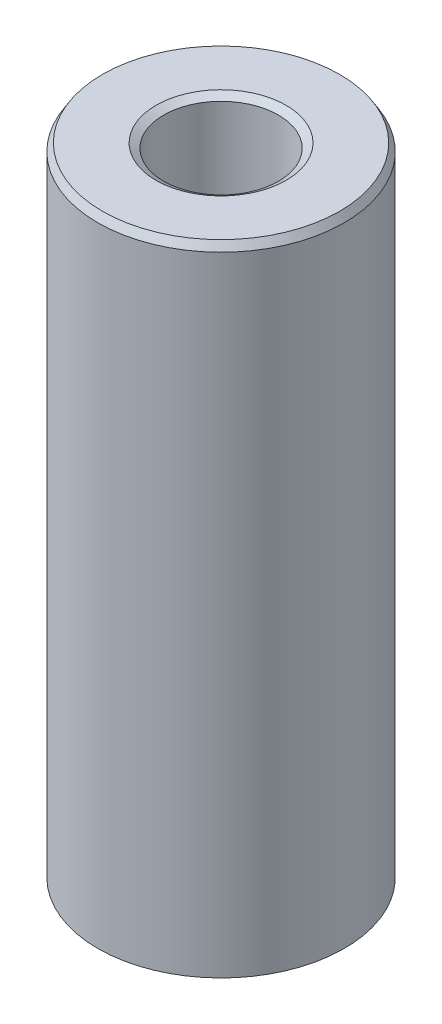
ISO-10303-21;
HEADER;
FILE_DESCRIPTION(('STEP AP214'),'2;1');
FILE_NAME('part.step','',(''),(''),'','','');
FILE_SCHEMA(('AUTOMOTIVE_DESIGN { 1 0 10303 214 1 1 1 1 }'));
ENDSEC;
DATA;
#1=APPLICATION_CONTEXT('core data for automotive mechanical design processes');
#2=APPLICATION_PROTOCOL_DEFINITION('international standard','automotive_design',2000,#1);
#3=PRODUCT_CONTEXT('',#1,'mechanical');
#4=PRODUCT('Part','Part','',(#3));
#5=PRODUCT_RELATED_PRODUCT_CATEGORY('part','',(#4));
#6=PRODUCT_DEFINITION_FORMATION('','',#4);
#7=PRODUCT_DEFINITION_CONTEXT('part definition',#1,'design');
#8=PRODUCT_DEFINITION('design','',#6,#7);
#9=PRODUCT_DEFINITION_SHAPE('','',#8);
#10=(LENGTH_UNIT() NAMED_UNIT(*) SI_UNIT(.MILLI.,.METRE.));
#11=(NAMED_UNIT(*) PLANE_ANGLE_UNIT() SI_UNIT($,.RADIAN.));
#12=(NAMED_UNIT(*) SI_UNIT($,.STERADIAN.) SOLID_ANGLE_UNIT());
#13=UNCERTAINTY_MEASURE_WITH_UNIT(LENGTH_MEASURE(1.E-05),#10,'distance_accuracy_value','');
#14=(GEOMETRIC_REPRESENTATION_CONTEXT(3) GLOBAL_UNCERTAINTY_ASSIGNED_CONTEXT((#13)) GLOBAL_UNIT_ASSIGNED_CONTEXT((#10,
#11,#12)) REPRESENTATION_CONTEXT('',''));
#15=CARTESIAN_POINT('',(0.,0.,0.));
#16=DIRECTION('',(0.,0.,1.));
#17=DIRECTION('',(1.,0.,0.));
#18=AXIS2_PLACEMENT_3D('',#15,#16,#17);
#19=CARTESIAN_POINT('',(0.,39.0098005050127,0.));
#20=DIRECTION('',(0.,-1.,0.));
#21=DIRECTION('',(0.,0.,-1.));
#22=AXIS2_PLACEMENT_3D('',#19,#20,#21);
#23=CYLINDRICAL_SURFACE('',#22,7.5);
#24=CARTESIAN_POINT('',(0.,0.280817783789404,0.));
#25=DIRECTION('',(0.,1.,0.));
#26=DIRECTION('',(0.,0.,1.));
#27=AXIS2_PLACEMENT_3D('',#24,#25,#26);
#28=CIRCLE('',#27,7.5);
#29=CARTESIAN_POINT('',(0.,0.280817783789404,7.5));
#30=VERTEX_POINT('',#29);
#31=EDGE_CURVE('E10',#30,#30,#28,.T.);
#32=ORIENTED_EDGE('',*,*,#31,.T.);
#33=EDGE_LOOP('',(#32));
#34=FACE_BOUND('',#33,.T.);
#35=CARTESIAN_POINT('',(0.,38.5429100247802,0.));
#36=DIRECTION('',(0.,1.,0.));
#37=DIRECTION('',(0.,0.,1.));
#38=AXIS2_PLACEMENT_3D('',#35,#36,#37);
#39=CIRCLE('',#38,7.5);
#40=CARTESIAN_POINT('',(0.,38.5429100247802,7.5));
#41=VERTEX_POINT('',#40);
#42=EDGE_CURVE('E50',#41,#41,#39,.F.);
#43=ORIENTED_EDGE('',*,*,#42,.T.);
#44=EDGE_LOOP('',(#43));
#45=FACE_BOUND('',#44,.T.);
#46=ADVANCED_FACE('F39',(#34,#45),#23,.T.);
#47=CARTESIAN_POINT('',(0.,39.0098005050127,0.));
#48=DIRECTION('',(0.,1.,0.));
#49=DIRECTION('',(0.,0.,1.));
#50=AXIS2_PLACEMENT_3D('',#47,#48,#49);
#51=PLANE('',#50);
#52=CARTESIAN_POINT('',(0.,39.0098005050127,0.));
#53=DIRECTION('',(0.,1.,0.));
#54=DIRECTION('',(0.,0.,1.));
#55=AXIS2_PLACEMENT_3D('',#52,#53,#54);
#56=CIRCLE('',#55,3.96074561842094);
#57=CARTESIAN_POINT('',(0.,39.0098005050127,3.96074561842094));
#58=VERTEX_POINT('',#57);
#59=EDGE_CURVE('E58',#58,#58,#56,.F.);
#60=ORIENTED_EDGE('',*,*,#59,.T.);
#61=EDGE_LOOP('',(#60));
#62=FACE_BOUND('',#61,.T.);
#63=CARTESIAN_POINT('',(0.,39.0098005050127,0.));
#64=DIRECTION('',(0.,1.,0.));
#65=DIRECTION('',(0.,0.,1.));
#66=AXIS2_PLACEMENT_3D('',#63,#64,#65);
#67=CIRCLE('',#66,7.21918221621058);
#68=CARTESIAN_POINT('',(0.,39.0098005050127,7.21918221621058));
#69=VERTEX_POINT('',#68);
#70=EDGE_CURVE('E61',#69,#69,#67,.T.);
#71=ORIENTED_EDGE('',*,*,#70,.T.);
#72=EDGE_LOOP('',(#71));
#73=FACE_BOUND('',#72,.T.);
#74=ADVANCED_FACE('F88',(#62,#73),#51,.T.);
#75=CARTESIAN_POINT('',(0.,0.,0.));
#76=DIRECTION('',(0.,1.,0.));
#77=DIRECTION('',(0.,0.,1.));
#78=AXIS2_PLACEMENT_3D('',#75,#76,#77);
#79=PLANE('',#78);
#80=CARTESIAN_POINT('',(0.,0.,0.));
#81=DIRECTION('',(0.,1.,0.));
#82=DIRECTION('',(0.,0.,1.));
#83=AXIS2_PLACEMENT_3D('',#80,#81,#82);
#84=CIRCLE('',#83,3.77467292197792);
#85=CARTESIAN_POINT('',(0.,0.,3.77467292197792));
#86=VERTEX_POINT('',#85);
#87=EDGE_CURVE('E51',#86,#86,#84,.T.);
#88=ORIENTED_EDGE('',*,*,#87,.T.);
#89=EDGE_LOOP('',(#88));
#90=FACE_BOUND('',#89,.T.);
#91=CARTESIAN_POINT('',(0.,0.,0.));
#92=DIRECTION('',(0.,1.,0.));
#93=DIRECTION('',(0.,0.,1.));
#94=AXIS2_PLACEMENT_3D('',#91,#92,#93);
#95=CIRCLE('',#94,7.03310951976756);
#96=CARTESIAN_POINT('',(0.,0.,7.03310951976756));
#97=VERTEX_POINT('',#96);
#98=EDGE_CURVE('E54',#97,#97,#95,.F.);
#99=ORIENTED_EDGE('',*,*,#98,.T.);
#100=EDGE_LOOP('',(#99));
#101=FACE_BOUND('',#100,.T.);
#102=ADVANCED_FACE('F83',(#90,#101),#79,.F.);
#103=CARTESIAN_POINT('',(0.,39.0098005050127,0.));
#104=DIRECTION('',(0.,-1.,0.));
#105=DIRECTION('',(0.,0.,-1.));
#106=AXIS2_PLACEMENT_3D('',#103,#104,#105);
#107=CYLINDRICAL_SURFACE('',#106,3.49385513818851);
#108=CARTESIAN_POINT('',(0.,38.7289827212233,0.));
#109=DIRECTION('',(0.,1.,0.));
#110=DIRECTION('',(0.,0.,1.));
#111=AXIS2_PLACEMENT_3D('',#108,#109,#110);
#112=CIRCLE('',#111,3.49385513818851);
#113=CARTESIAN_POINT('',(0.,38.7289827212233,3.4938551381885));
#114=VERTEX_POINT('',#113);
#115=EDGE_CURVE('E67',#114,#114,#112,.T.);
#116=ORIENTED_EDGE('',*,*,#115,.T.);
#117=EDGE_LOOP('',(#116));
#118=FACE_BOUND('',#117,.T.);
#119=CARTESIAN_POINT('',(0.,0.466890480232435,0.));
#120=DIRECTION('',(0.,1.,0.));
#121=DIRECTION('',(0.,0.,1.));
#122=AXIS2_PLACEMENT_3D('',#119,#120,#121);
#123=CIRCLE('',#122,3.49385513818851);
#124=CARTESIAN_POINT('',(0.,0.466890480232435,3.49385513818851));
#125=VERTEX_POINT('',#124);
#126=EDGE_CURVE('E69',#125,#125,#123,.F.);
#127=ORIENTED_EDGE('',*,*,#126,.T.);
#128=EDGE_LOOP('',(#127));
#129=FACE_BOUND('',#128,.T.);
#130=ADVANCED_FACE('F71',(#118,#129),#107,.F.);
#131=CARTESIAN_POINT('',(0.,38.7289827212233,0.));
#132=DIRECTION('',(0.,1.,0.));
#133=DIRECTION('',(0.,0.,1.));
#134=AXIS2_PLACEMENT_3D('',#131,#132,#133);
#135=CONICAL_SURFACE('',#134,3.49385513818851,1.02930110152719);
#136=CARTESIAN_POINT('',(0.,39.0098005050127,3.96074561842094));
#137=CARTESIAN_POINT('',(0.,39.0068753197649,3.95588217591851));
#138=CARTESIAN_POINT('',(0.,39.0039501345171,3.95101873341609));
#139=CARTESIAN_POINT('',(0.,38.9980997640215,3.94129184841125));
#140=CARTESIAN_POINT('',(0.,38.9951745787737,3.93642840590883));
#141=CARTESIAN_POINT('',(0.,38.9893242082781,3.92670152090399));
#142=CARTESIAN_POINT('',(0.,38.9863990230302,3.92183807840157));
#143=CARTESIAN_POINT('',(0.,38.9805486525346,3.91211119339672));
#144=CARTESIAN_POINT('',(0.,38.9776234672868,3.9072477508943));
#145=CARTESIAN_POINT('',(0.,38.9717730967912,3.89752086588946));
#146=CARTESIAN_POINT('',(0.,38.9688479115434,3.89265742338704));
#147=CARTESIAN_POINT('',(0.,38.9629975410478,3.8829305383822));
#148=CARTESIAN_POINT('',(0.,38.9600723558,3.87806709587978));
#149=CARTESIAN_POINT('',(0.,38.9542219853044,3.86834021087493));
#150=CARTESIAN_POINT('',(0.,38.9512968000566,3.86347676837251));
#151=CARTESIAN_POINT('',(0.,38.945446429561,3.85374988336767));
#152=CARTESIAN_POINT('',(0.,38.9425212443131,3.84888644086525));
#153=CARTESIAN_POINT('',(0.,38.9366708738175,3.83915955586041));
#154=CARTESIAN_POINT('',(0.,38.9337456885697,3.83429611335799));
#155=CARTESIAN_POINT('',(0.,38.9278953180741,3.82456922835314));
#156=CARTESIAN_POINT('',(0.,38.9249701328263,3.81970578585072));
#157=CARTESIAN_POINT('',(0.,38.9191197623307,3.80997890084588));
#158=CARTESIAN_POINT('',(0.,38.9161945770829,3.80511545834346));
#159=CARTESIAN_POINT('',(0.,38.9103442065873,3.79538857333862));
#160=CARTESIAN_POINT('',(0.,38.9074190213395,3.79052513083619));
#161=CARTESIAN_POINT('',(0.,38.9015686508439,3.78079824583135));
#162=CARTESIAN_POINT('',(0.,38.8986434655961,3.77593480332893));
#163=CARTESIAN_POINT('',(0.,38.8927930951004,3.76620791832409));
#164=CARTESIAN_POINT('',(0.,38.8898679098526,3.76134447582167));
#165=CARTESIAN_POINT('',(0.,38.884017539357,3.75161759081683));
#166=CARTESIAN_POINT('',(0.,38.8810923541092,3.7467541483144));
#167=CARTESIAN_POINT('',(0.,38.8752419836136,3.73702726330956));
#168=CARTESIAN_POINT('',(0.,38.8723167983658,3.73216382080714));
#169=CARTESIAN_POINT('',(0.,38.8664664278702,3.7224369358023));
#170=CARTESIAN_POINT('',(0.,38.8635412426224,3.71757349329988));
#171=CARTESIAN_POINT('',(0.,38.8576908721268,3.70784660829503));
#172=CARTESIAN_POINT('',(0.,38.854765686879,3.70298316579261));
#173=CARTESIAN_POINT('',(0.,38.8489153163833,3.69325628078777));
#174=CARTESIAN_POINT('',(0.,38.8459901311355,3.68839283828535));
#175=CARTESIAN_POINT('',(0.,38.8401397606399,3.67866595328051));
#176=CARTESIAN_POINT('',(0.,38.8372145753921,3.67380251077809));
#177=CARTESIAN_POINT('',(0.,38.8313642048965,3.66407562577324));
#178=CARTESIAN_POINT('',(0.,38.8284390196487,3.65921218327082));
#179=CARTESIAN_POINT('',(0.,38.8225886491531,3.64948529826598));
#180=CARTESIAN_POINT('',(0.,38.8196634639053,3.64462185576356));
#181=CARTESIAN_POINT('',(0.,38.8138130934097,3.63489497075872));
#182=CARTESIAN_POINT('',(0.,38.8108879081619,3.6300315282563));
#183=CARTESIAN_POINT('',(0.,38.8050375376663,3.62030464325145));
#184=CARTESIAN_POINT('',(0.,38.8021123524184,3.61544120074903));
#185=CARTESIAN_POINT('',(0.,38.7962619819228,3.60571431574419));
#186=CARTESIAN_POINT('',(0.,38.793336796675,3.60085087324177));
#187=CARTESIAN_POINT('',(0.,38.7874864261794,3.59112398823693));
#188=CARTESIAN_POINT('',(0.,38.7845612409316,3.58626054573451));
#189=CARTESIAN_POINT('',(0.,38.778710870436,3.57653366072966));
#190=CARTESIAN_POINT('',(0.,38.7757856851882,3.57167021822724));
#191=CARTESIAN_POINT('',(0.,38.7699353146926,3.5619433332224));
#192=CARTESIAN_POINT('',(0.,38.7670101294448,3.55707989071998));
#193=CARTESIAN_POINT('',(0.,38.7611597589492,3.54735300571514));
#194=CARTESIAN_POINT('',(0.,38.7582345737013,3.54248956321272));
#195=CARTESIAN_POINT('',(0.,38.7523842032057,3.53276267820787));
#196=CARTESIAN_POINT('',(0.,38.7494590179579,3.52789923570545));
#197=CARTESIAN_POINT('',(0.,38.7436086474623,3.51817235070061));
#198=CARTESIAN_POINT('',(0.,38.7406834622145,3.51330890819819));
#199=CARTESIAN_POINT('',(0.,38.7348330917189,3.50358202319335));
#200=CARTESIAN_POINT('',(0.,38.7319079064711,3.49871858069093));
#201=CARTESIAN_POINT('',(0.,38.7289827212233,3.4938551381885));
#202=B_SPLINE_CURVE_WITH_KNOTS('',3,(#136,#137,#138,#139,#140,#141,#142,#143,#144,#145,#146,
#147,#148,#149,#150,#151,#152,#153,#154,#155,#156,#157,#158,#159,#160,#161,#162,#163,#164,#165,
#166,#167,#168,#169,#170,#171,#172,#173,#174,#175,#176,#177,#178,#179,#180,#181,#182,#183,#184,
#185,#186,#187,#188,#189,#190,#191,#192,#193,#194,#195,#196,#197,#198,#199,#200,#201),
.UNSPECIFIED.,.F.,.F.,(4,2,2,2,2,2,2,2,2,2,2,2,2,2,2,2,2,2,2,2,2,2,2,2,2,2,2,2,2,2,2,2,4),(0.,
0.0170260986539759,0.0340521973079562,0.0510782959619364,0.0681043946159167,0.085130493269897,
0.102156591923877,0.119182690577857,0.136208789231837,0.153234887885818,0.170260986539798,
0.187287085193778,0.204313183847758,0.221339282501738,0.238365381155719,0.255391479809699,
0.272417578463679,0.289443677117659,0.306469775771639,0.323495874425619,0.340521973079599,
0.35754807173358,0.37457417038756,0.39160026904154,0.40862636769552,0.4256524663495,
0.44267856500348,0.459704663657461,0.476730762311441,0.493756860965421,0.510782959619401,
0.527809058273381,0.544835156927358),.UNSPECIFIED.);
#203=EDGE_CURVE('BSEAM77',#58,#114,#202,.T.);
#204=ORIENTED_EDGE('',*,*,#59,.F.);
#205=ORIENTED_EDGE('',*,*,#115,.F.);
#206=ORIENTED_EDGE('',*,*,#203,.T.);
#207=ORIENTED_EDGE('',*,*,#203,.F.);
#208=EDGE_LOOP('',(#204,#206,#205,#207));
#209=FACE_BOUND('',#208,.T.);
#210=ADVANCED_FACE('F77',(#209),#135,.F.);
#211=CARTESIAN_POINT('',(0.,0.,0.));
#212=DIRECTION('',(0.,-1.,0.));
#213=DIRECTION('',(0.,0.,-1.));
#214=AXIS2_PLACEMENT_3D('',#211,#212,#213);
#215=CONICAL_SURFACE('',#214,3.77467292197792,0.541495225267712);
#216=ORIENTED_EDGE('',*,*,#126,.F.);
#217=EDGE_LOOP('',(#216));
#218=FACE_BOUND('',#217,.T.);
#219=ORIENTED_EDGE('',*,*,#87,.F.);
#220=EDGE_LOOP('',(#219));
#221=FACE_BOUND('',#220,.T.);
#222=ADVANCED_FACE('F73',(#218,#221),#215,.F.);
#223=CARTESIAN_POINT('',(0.,0.280817783789404,0.));
#224=DIRECTION('',(0.,1.,0.));
#225=DIRECTION('',(0.,0.,1.));
#226=AXIS2_PLACEMENT_3D('',#223,#224,#225);
#227=CONICAL_SURFACE('',#226,7.5,1.02930110152719);
#228=CARTESIAN_POINT('',(0.,0.,7.03310951976756));
#229=CARTESIAN_POINT('',(0.,0.00292518524780624,7.03797296226999));
#230=CARTESIAN_POINT('',(0.,0.00585037049561253,7.04283640477241));
#231=CARTESIAN_POINT('',(0.,0.0117007409912251,7.05256328977725));
#232=CARTESIAN_POINT('',(0.,0.0146259262390314,7.05742673227967));
#233=CARTESIAN_POINT('',(0.,0.020476296734644,7.06715361728451));
#234=CARTESIAN_POINT('',(0.,0.0234014819824503,7.07201705978694));
#235=CARTESIAN_POINT('',(0.,0.0292518524780629,7.08174394479178));
#236=CARTESIAN_POINT('',(0.,0.0321770377258692,7.0866073872942));
#237=CARTESIAN_POINT('',(0.,0.0380274082214817,7.09633427229904));
#238=CARTESIAN_POINT('',(0.,0.040952593469288,7.10119771480146));
#239=CARTESIAN_POINT('',(0.,0.0468029639649006,7.1109245998063));
#240=CARTESIAN_POINT('',(0.,0.0497281492127069,7.11578804230873));
#241=CARTESIAN_POINT('',(0.,0.0555785197083195,7.12551492731357));
#242=CARTESIAN_POINT('',(0.,0.0585037049561258,7.13037836981599));
#243=CARTESIAN_POINT('',(0.,0.0643540754517384,7.14010525482083));
#244=CARTESIAN_POINT('',(0.,0.0672792606995447,7.14496869732325));
#245=CARTESIAN_POINT('',(0.,0.0731296311951573,7.15469558232809));
#246=CARTESIAN_POINT('',(0.,0.0760548164429636,7.15955902483052));
#247=CARTESIAN_POINT('',(0.,0.0819051869385761,7.16928590983536));
#248=CARTESIAN_POINT('',(0.,0.0848303721863824,7.17414935233778));
#249=CARTESIAN_POINT('',(0.,0.090680742681995,7.18387623734262));
#250=CARTESIAN_POINT('',(0.,0.0936059279298013,7.18873967984504));
#251=CARTESIAN_POINT('',(0.,0.0994562984254139,7.19846656484988));
#252=CARTESIAN_POINT('',(0.,0.10238148367322,7.20333000735231));
#253=CARTESIAN_POINT('',(0.,0.108231854168833,7.21305689235715));
#254=CARTESIAN_POINT('',(0.,0.111157039416639,7.21792033485957));
#255=CARTESIAN_POINT('',(0.,0.117007409912252,7.22764721986441));
#256=CARTESIAN_POINT('',(0.,0.119932595160058,7.23251066236683));
#257=CARTESIAN_POINT('',(0.,0.125782965655671,7.24223754737168));
#258=CARTESIAN_POINT('',(0.,0.128708150903477,7.2471009898741));
#259=CARTESIAN_POINT('',(0.,0.134558521399089,7.25682787487894));
#260=CARTESIAN_POINT('',(0.,0.137483706646896,7.26169131738136));
#261=CARTESIAN_POINT('',(0.,0.143334077142508,7.2714182023862));
#262=CARTESIAN_POINT('',(0.,0.146259262390315,7.27628164488863));
#263=CARTESIAN_POINT('',(0.,0.152109632885927,7.28600852989347));
#264=CARTESIAN_POINT('',(0.,0.155034818133733,7.29087197239589));
#265=CARTESIAN_POINT('',(0.,0.160885188629346,7.30059885740073));
#266=CARTESIAN_POINT('',(0.,0.163810373877152,7.30546229990315));
#267=CARTESIAN_POINT('',(0.,0.169660744372765,7.31518918490799));
#268=CARTESIAN_POINT('',(0.,0.172585929620571,7.32005262741042));
#269=CARTESIAN_POINT('',(0.,0.178436300116184,7.32977951241526));
#270=CARTESIAN_POINT('',(0.,0.18136148536399,7.33464295491768));
#271=CARTESIAN_POINT('',(0.,0.187211855859603,7.34436983992252));
#272=CARTESIAN_POINT('',(0.,0.190137041107409,7.34923328242494));
#273=CARTESIAN_POINT('',(0.,0.195987411603022,7.35896016742978));
#274=CARTESIAN_POINT('',(0.,0.198912596850828,7.36382360993221));
#275=CARTESIAN_POINT('',(0.,0.20476296734644,7.37355049493705));
#276=CARTESIAN_POINT('',(0.,0.207688152594247,7.37841393743947));
#277=CARTESIAN_POINT('',(0.,0.213538523089859,7.38814082244431));
#278=CARTESIAN_POINT('',(0.,0.216463708337666,7.39300426494673));
#279=CARTESIAN_POINT('',(0.,0.222314078833278,7.40273114995158));
#280=CARTESIAN_POINT('',(0.,0.225239264081085,7.407594592454));
#281=CARTESIAN_POINT('',(0.,0.231089634576697,7.41732147745884));
#282=CARTESIAN_POINT('',(0.,0.234014819824503,7.42218491996126));
#283=CARTESIAN_POINT('',(0.,0.239865190320116,7.4319118049661));
#284=CARTESIAN_POINT('',(0.,0.242790375567922,7.43677524746852));
#285=CARTESIAN_POINT('',(0.,0.248640746063535,7.44650213247337));
#286=CARTESIAN_POINT('',(0.,0.251565931311341,7.45136557497579));
#287=CARTESIAN_POINT('',(0.,0.257416301806954,7.46109245998063));
#288=CARTESIAN_POINT('',(0.,0.26034148705476,7.46595590248305));
#289=CARTESIAN_POINT('',(0.,0.266191857550373,7.47568278748789));
#290=CARTESIAN_POINT('',(0.,0.269117042798179,7.48054622999032));
#291=CARTESIAN_POINT('',(0.,0.274967413293791,7.49027311499516));
#292=CARTESIAN_POINT('',(0.,0.277892598541598,7.49513655749758));
#293=CARTESIAN_POINT('',(0.,0.280817783789404,7.5));
#294=B_SPLINE_CURVE_WITH_KNOTS('',3,(#228,#229,#230,#231,#232,#233,#234,#235,#236,#237,#238,
#239,#240,#241,#242,#243,#244,#245,#246,#247,#248,#249,#250,#251,#252,#253,#254,#255,#256,#257,
#258,#259,#260,#261,#262,#263,#264,#265,#266,#267,#268,#269,#270,#271,#272,#273,#274,#275,#276,
#277,#278,#279,#280,#281,#282,#283,#284,#285,#286,#287,#288,#289,#290,#291,#292,#293),
.UNSPECIFIED.,.F.,.F.,(4,2,2,2,2,2,2,2,2,2,2,2,2,2,2,2,2,2,2,2,2,2,2,2,2,2,2,2,2,2,2,2,4),(0.,
0.0170260986539801,0.0340521973079603,0.0510782959619404,0.0681043946159206,0.0851304932699007,
0.102156591923881,0.119182690577861,0.136208789231841,0.153234887885821,0.170260986539801,
0.187287085193782,0.204313183847762,0.221339282501742,0.238365381155722,0.255391479809702,
0.272417578463682,0.289443677117662,0.306469775771643,0.323495874425623,0.340521973079603,
0.357548071733583,0.374574170387563,0.391600269041543,0.408626367695523,0.425652466349503,
0.442678565003484,0.459704663657464,0.476730762311444,0.493756860965424,0.510782959619404,
0.527809058273384,0.544835156927364),.UNSPECIFIED.);
#295=EDGE_CURVE('BSEAM76',#97,#30,#294,.T.);
#296=ORIENTED_EDGE('',*,*,#98,.F.);
#297=ORIENTED_EDGE('',*,*,#31,.F.);
#298=ORIENTED_EDGE('',*,*,#295,.T.);
#299=ORIENTED_EDGE('',*,*,#295,.F.);
#300=EDGE_LOOP('',(#296,#298,#297,#299));
#301=FACE_BOUND('',#300,.T.);
#302=ADVANCED_FACE('F76',(#301),#227,.T.);
#303=CARTESIAN_POINT('',(0.,39.0098005050127,0.));
#304=DIRECTION('',(0.,-1.,0.));
#305=DIRECTION('',(0.,0.,-1.));
#306=AXIS2_PLACEMENT_3D('',#303,#304,#305);
#307=CONICAL_SURFACE('',#306,7.21918221621058,0.541495225267709);
#308=ORIENTED_EDGE('',*,*,#42,.F.);
#309=EDGE_LOOP('',(#308));
#310=FACE_BOUND('',#309,.T.);
#311=ORIENTED_EDGE('',*,*,#70,.F.);
#312=EDGE_LOOP('',(#311));
#313=FACE_BOUND('',#312,.T.);
#314=ADVANCED_FACE('F45',(#310,#313),#307,.T.);
#315=CLOSED_SHELL('',(#46,#74,#102,#130,#210,#222,#302,#314));
#316=MANIFOLD_SOLID_BREP('B2',#315);
#317=ADVANCED_BREP_SHAPE_REPRESENTATION('',(#18,#316),#14);
#318=SHAPE_DEFINITION_REPRESENTATION(#9,#317);
ENDSEC;
END-ISO-10303-21;
